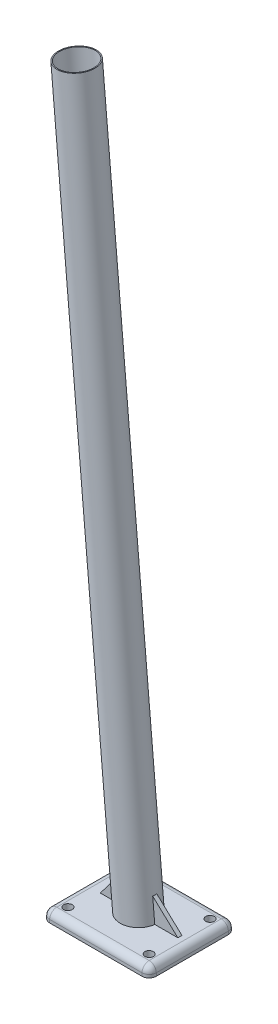
ISO-10303-21;
HEADER;
FILE_DESCRIPTION(('STEP AP214'),'2;1');
FILE_NAME('part.step','',(''),(''),'','','');
FILE_SCHEMA(('AUTOMOTIVE_DESIGN { 1 0 10303 214 1 1 1 1 }'));
ENDSEC;
DATA;
#1=APPLICATION_CONTEXT('core data for automotive mechanical design processes');
#2=APPLICATION_PROTOCOL_DEFINITION('international standard','automotive_design',2000,#1);
#3=PRODUCT_CONTEXT('',#1,'mechanical');
#4=PRODUCT('Part','Part','',(#3));
#5=PRODUCT_RELATED_PRODUCT_CATEGORY('part','',(#4));
#6=PRODUCT_DEFINITION_FORMATION('','',#4);
#7=PRODUCT_DEFINITION_CONTEXT('part definition',#1,'design');
#8=PRODUCT_DEFINITION('design','',#6,#7);
#9=PRODUCT_DEFINITION_SHAPE('','',#8);
#10=(LENGTH_UNIT() NAMED_UNIT(*) SI_UNIT(.MILLI.,.METRE.));
#11=(NAMED_UNIT(*) PLANE_ANGLE_UNIT() SI_UNIT($,.RADIAN.));
#12=(NAMED_UNIT(*) SI_UNIT($,.STERADIAN.) SOLID_ANGLE_UNIT());
#13=UNCERTAINTY_MEASURE_WITH_UNIT(LENGTH_MEASURE(1.E-05),#10,'distance_accuracy_value','');
#14=(GEOMETRIC_REPRESENTATION_CONTEXT(3) GLOBAL_UNCERTAINTY_ASSIGNED_CONTEXT((#13)) GLOBAL_UNIT_ASSIGNED_CONTEXT((#10,
#11,#12)) REPRESENTATION_CONTEXT('',''));
#15=CARTESIAN_POINT('',(0.,0.,0.));
#16=DIRECTION('',(0.,0.,1.));
#17=DIRECTION('',(1.,0.,0.));
#18=AXIS2_PLACEMENT_3D('',#15,#16,#17);
#19=CARTESIAN_POINT('',(0.,10.,0.));
#20=DIRECTION('',(0.,1.,0.));
#21=DIRECTION('',(0.,0.,1.));
#22=AXIS2_PLACEMENT_3D('',#19,#20,#21);
#23=PLANE('',#22);
#24=DIRECTION('',(0.,0.,-1.));
#25=VECTOR('',#24,1.);
#26=CARTESIAN_POINT('',(45.5,10.,-42.5));
#27=LINE('',#26,#25);
#28=CARTESIAN_POINT('',(45.5,10.,35.5));
#29=VERTEX_POINT('',#28);
#30=CARTESIAN_POINT('',(45.5,10.,-35.5));
#31=VERTEX_POINT('',#30);
#32=EDGE_CURVE('E257',#29,#31,#27,.T.);
#33=ORIENTED_EDGE('',*,*,#32,.T.);
#34=DIRECTION('',(-1.,0.,0.));
#35=VECTOR('',#34,1.);
#36=CARTESIAN_POINT('',(-45.5,10.,-35.5));
#37=LINE('',#36,#35);
#38=CARTESIAN_POINT('',(-45.5,10.,-35.5));
#39=VERTEX_POINT('',#38);
#40=EDGE_CURVE('E47',#31,#39,#37,.T.);
#41=ORIENTED_EDGE('',*,*,#40,.T.);
#42=DIRECTION('',(0.,0.,1.));
#43=VECTOR('',#42,1.);
#44=CARTESIAN_POINT('',(-45.5,10.,42.5));
#45=LINE('',#44,#43);
#46=CARTESIAN_POINT('',(-45.5,10.,35.5));
#47=VERTEX_POINT('',#46);
#48=EDGE_CURVE('E254',#39,#47,#45,.T.);
#49=ORIENTED_EDGE('',*,*,#48,.T.);
#50=DIRECTION('',(1.,0.,0.));
#51=VECTOR('',#50,1.);
#52=CARTESIAN_POINT('',(45.5,10.,35.5));
#53=LINE('',#52,#51);
#54=EDGE_CURVE('E307',#47,#29,#53,.T.);
#55=ORIENTED_EDGE('',*,*,#54,.T.);
#56=EDGE_LOOP('',(#33,#41,#49,#55));
#57=FACE_BOUND('',#56,.T.);
#58=DIRECTION('',(0.,0.,1.));
#59=VECTOR('',#58,1.);
#60=CARTESIAN_POINT('',(40.2682259659091,10.,0.));
#61=LINE('',#60,#59);
#62=CARTESIAN_POINT('',(40.2682259659091,10.,2.));
#63=VERTEX_POINT('',#62);
#64=CARTESIAN_POINT('',(40.2682259659091,10.,-2.));
#65=VERTEX_POINT('',#64);
#66=EDGE_CURVE('E202',#63,#65,#61,.F.);
#67=ORIENTED_EDGE('',*,*,#66,.F.);
#68=DIRECTION('',(1.,0.,0.));
#69=VECTOR('',#68,1.);
#70=CARTESIAN_POINT('',(0.,10.,2.));
#71=LINE('',#70,#69);
#72=CARTESIAN_POINT('',(17.5194318336482,10.,2.));
#73=VERTEX_POINT('',#72);
#74=EDGE_CURVE('E199',#73,#63,#71,.T.);
#75=ORIENTED_EDGE('',*,*,#74,.F.);
#76=CARTESIAN_POINT('',(-0.437443317629597,10.,0.));
#77=DIRECTION('',(0.,1.,0.));
#78=DIRECTION('',(-1.,0.,0.));
#79=AXIS2_PLACEMENT_3D('',#76,#77,#78);
#80=ELLIPSE('',#79,18.0687570757802,18.);
#81=CARTESIAN_POINT('',(-18.3943184689074,10.,2.));
#82=VERTEX_POINT('',#81);
#83=EDGE_CURVE('E163',#73,#82,#80,.F.);
#84=ORIENTED_EDGE('',*,*,#83,.T.);
#85=DIRECTION('',(1.,0.,0.));
#86=VECTOR('',#85,1.);
#87=CARTESIAN_POINT('',(0.,10.,2.));
#88=LINE('',#87,#86);
#89=CARTESIAN_POINT('',(-36.1381515078671,10.,2.));
#90=VERTEX_POINT('',#89);
#91=EDGE_CURVE('E184',#90,#82,#88,.T.);
#92=ORIENTED_EDGE('',*,*,#91,.F.);
#93=DIRECTION('',(0.,0.,1.));
#94=VECTOR('',#93,1.);
#95=CARTESIAN_POINT('',(-36.1381515078671,10.,0.));
#96=LINE('',#95,#94);
#97=CARTESIAN_POINT('',(-36.1381515078671,10.,-2.));
#98=VERTEX_POINT('',#97);
#99=EDGE_CURVE('E170',#98,#90,#96,.T.);
#100=ORIENTED_EDGE('',*,*,#99,.F.);
#101=DIRECTION('',(1.,0.,0.));
#102=VECTOR('',#101,1.);
#103=CARTESIAN_POINT('',(0.,10.,-2.));
#104=LINE('',#103,#102);
#105=CARTESIAN_POINT('',(-18.3943184689074,10.,-2.));
#106=VERTEX_POINT('',#105);
#107=EDGE_CURVE('E167',#98,#106,#104,.T.);
#108=ORIENTED_EDGE('',*,*,#107,.T.);
#109=CARTESIAN_POINT('',(17.5194318336482,10.,-2.));
#110=VERTEX_POINT('',#109);
#111=EDGE_CURVE('E152',#106,#110,#80,.F.);
#112=ORIENTED_EDGE('',*,*,#111,.T.);
#113=DIRECTION('',(1.,0.,0.));
#114=VECTOR('',#113,1.);
#115=CARTESIAN_POINT('',(0.,10.,-2.));
#116=LINE('',#115,#114);
#117=EDGE_CURVE('E195',#110,#65,#116,.T.);
#118=ORIENTED_EDGE('',*,*,#117,.T.);
#119=EDGE_LOOP('',(#67,#75,#84,#92,#100,#108,#112,#118));
#120=FACE_BOUND('',#119,.T.);
#121=CARTESIAN_POINT('',(40.,10.,30.));
#122=DIRECTION('',(0.,1.,0.));
#123=DIRECTION('',(0.,0.,1.));
#124=AXIS2_PLACEMENT_3D('',#121,#122,#123);
#125=CIRCLE('',#124,4.2);
#126=CARTESIAN_POINT('',(40.,10.,34.2));
#127=VERTEX_POINT('',#126);
#128=EDGE_CURVE('E219',#127,#127,#125,.T.);
#129=ORIENTED_EDGE('',*,*,#128,.F.);
#130=EDGE_LOOP('',(#129));
#131=FACE_BOUND('',#130,.T.);
#132=CARTESIAN_POINT('',(-40.,10.,30.));
#133=DIRECTION('',(0.,1.,0.));
#134=DIRECTION('',(0.,0.,1.));
#135=AXIS2_PLACEMENT_3D('',#132,#133,#134);
#136=CIRCLE('',#135,4.2);
#137=CARTESIAN_POINT('',(-40.,10.,34.2));
#138=VERTEX_POINT('',#137);
#139=EDGE_CURVE('E231',#138,#138,#136,.T.);
#140=ORIENTED_EDGE('',*,*,#139,.F.);
#141=EDGE_LOOP('',(#140));
#142=FACE_BOUND('',#141,.T.);
#143=CARTESIAN_POINT('',(40.,10.,-30.));
#144=DIRECTION('',(0.,1.,0.));
#145=DIRECTION('',(0.,0.,1.));
#146=AXIS2_PLACEMENT_3D('',#143,#144,#145);
#147=CIRCLE('',#146,4.2);
#148=CARTESIAN_POINT('',(40.,10.,-25.8));
#149=VERTEX_POINT('',#148);
#150=EDGE_CURVE('E225',#149,#149,#147,.T.);
#151=ORIENTED_EDGE('',*,*,#150,.F.);
#152=EDGE_LOOP('',(#151));
#153=FACE_BOUND('',#152,.T.);
#154=CARTESIAN_POINT('',(-40.,10.,-30.));
#155=DIRECTION('',(0.,1.,0.));
#156=DIRECTION('',(0.,0.,1.));
#157=AXIS2_PLACEMENT_3D('',#154,#155,#156);
#158=CIRCLE('',#157,4.2);
#159=CARTESIAN_POINT('',(-40.,10.,-25.8));
#160=VERTEX_POINT('',#159);
#161=EDGE_CURVE('E213',#160,#160,#158,.T.);
#162=ORIENTED_EDGE('',*,*,#161,.F.);
#163=EDGE_LOOP('',(#162));
#164=FACE_BOUND('',#163,.T.);
#165=ADVANCED_FACE('F38',(#57,#120,#131,#142,#153,#164),#23,.T.);
#166=CARTESIAN_POINT('',(0.,0.,0.));
#167=DIRECTION('',(0.,1.,0.));
#168=DIRECTION('',(0.,0.,1.));
#169=AXIS2_PLACEMENT_3D('',#166,#167,#168);
#170=PLANE('',#169);
#171=DIRECTION('',(-1.,0.,0.));
#172=VECTOR('',#171,1.);
#173=CARTESIAN_POINT('',(52.5,0.,-42.5));
#174=LINE('',#173,#172);
#175=CARTESIAN_POINT('',(45.5,0.,-42.5));
#176=VERTEX_POINT('',#175);
#177=CARTESIAN_POINT('',(-45.5,0.,-42.5));
#178=VERTEX_POINT('',#177);
#179=EDGE_CURVE('E164',#176,#178,#174,.T.);
#180=ORIENTED_EDGE('',*,*,#179,.F.);
#181=CARTESIAN_POINT('',(45.5,0.,-35.5));
#182=DIRECTION('',(0.,1.,0.));
#183=DIRECTION('',(0.,0.,1.));
#184=AXIS2_PLACEMENT_3D('',#181,#182,#183);
#185=CIRCLE('',#184,7.);
#186=CARTESIAN_POINT('',(52.5,0.,-35.5));
#187=VERTEX_POINT('',#186);
#188=EDGE_CURVE('E289',#176,#187,#185,.F.);
#189=ORIENTED_EDGE('',*,*,#188,.T.);
#190=DIRECTION('',(0.,0.,-1.));
#191=VECTOR('',#190,1.);
#192=CARTESIAN_POINT('',(52.5,0.,42.5));
#193=LINE('',#192,#191);
#194=CARTESIAN_POINT('',(52.5,0.,35.5));
#195=VERTEX_POINT('',#194);
#196=EDGE_CURVE('E241',#195,#187,#193,.T.);
#197=ORIENTED_EDGE('',*,*,#196,.F.);
#198=CARTESIAN_POINT('',(45.5,0.,35.5));
#199=DIRECTION('',(0.,1.,0.));
#200=DIRECTION('',(0.,0.,1.));
#201=AXIS2_PLACEMENT_3D('',#198,#199,#200);
#202=CIRCLE('',#201,7.);
#203=CARTESIAN_POINT('',(45.5,0.,42.5));
#204=VERTEX_POINT('',#203);
#205=EDGE_CURVE('E268',#195,#204,#202,.F.);
#206=ORIENTED_EDGE('',*,*,#205,.T.);
#207=DIRECTION('',(1.,0.,0.));
#208=VECTOR('',#207,1.);
#209=CARTESIAN_POINT('',(52.5,0.,42.5));
#210=LINE('',#209,#208);
#211=CARTESIAN_POINT('',(-45.5,0.,42.5));
#212=VERTEX_POINT('',#211);
#213=EDGE_CURVE('E238',#212,#204,#210,.T.);
#214=ORIENTED_EDGE('',*,*,#213,.F.);
#215=CARTESIAN_POINT('',(-45.5,0.,35.5));
#216=DIRECTION('',(0.,1.,0.));
#217=DIRECTION('',(0.,0.,1.));
#218=AXIS2_PLACEMENT_3D('',#215,#216,#217);
#219=CIRCLE('',#218,7.);
#220=CARTESIAN_POINT('',(-52.5,0.,35.5));
#221=VERTEX_POINT('',#220);
#222=EDGE_CURVE('E265',#212,#221,#219,.F.);
#223=ORIENTED_EDGE('',*,*,#222,.T.);
#224=DIRECTION('',(0.,0.,1.));
#225=VECTOR('',#224,1.);
#226=CARTESIAN_POINT('',(-52.5,0.,42.5));
#227=LINE('',#226,#225);
#228=CARTESIAN_POINT('',(-52.5,0.,-35.5));
#229=VERTEX_POINT('',#228);
#230=EDGE_CURVE('E234',#229,#221,#227,.T.);
#231=ORIENTED_EDGE('',*,*,#230,.F.);
#232=CARTESIAN_POINT('',(-45.5,0.,-35.5));
#233=DIRECTION('',(0.,1.,0.));
#234=DIRECTION('',(0.,0.,1.));
#235=AXIS2_PLACEMENT_3D('',#232,#233,#234);
#236=CIRCLE('',#235,7.);
#237=EDGE_CURVE('E287',#229,#178,#236,.F.);
#238=ORIENTED_EDGE('',*,*,#237,.T.);
#239=EDGE_LOOP('',(#180,#189,#197,#206,#214,#223,#231,#238));
#240=FACE_BOUND('',#239,.T.);
#241=CARTESIAN_POINT('',(-40.,0.,30.));
#242=DIRECTION('',(0.,1.,0.));
#243=DIRECTION('',(0.,0.,1.));
#244=AXIS2_PLACEMENT_3D('',#241,#242,#243);
#245=CIRCLE('',#244,4.2);
#246=CARTESIAN_POINT('',(-40.,0.,34.2));
#247=VERTEX_POINT('',#246);
#248=EDGE_CURVE('E228',#247,#247,#245,.T.);
#249=ORIENTED_EDGE('',*,*,#248,.T.);
#250=EDGE_LOOP('',(#249));
#251=FACE_BOUND('',#250,.T.);
#252=CARTESIAN_POINT('',(40.,0.,-30.));
#253=DIRECTION('',(0.,1.,0.));
#254=DIRECTION('',(0.,0.,1.));
#255=AXIS2_PLACEMENT_3D('',#252,#253,#254);
#256=CIRCLE('',#255,4.2);
#257=CARTESIAN_POINT('',(40.,0.,-25.8));
#258=VERTEX_POINT('',#257);
#259=EDGE_CURVE('E222',#258,#258,#256,.T.);
#260=ORIENTED_EDGE('',*,*,#259,.T.);
#261=EDGE_LOOP('',(#260));
#262=FACE_BOUND('',#261,.T.);
#263=CARTESIAN_POINT('',(40.,0.,30.));
#264=DIRECTION('',(0.,1.,0.));
#265=DIRECTION('',(0.,0.,1.));
#266=AXIS2_PLACEMENT_3D('',#263,#264,#265);
#267=CIRCLE('',#266,4.2);
#268=CARTESIAN_POINT('',(40.,0.,34.2));
#269=VERTEX_POINT('',#268);
#270=EDGE_CURVE('E216',#269,#269,#267,.T.);
#271=ORIENTED_EDGE('',*,*,#270,.T.);
#272=EDGE_LOOP('',(#271));
#273=FACE_BOUND('',#272,.T.);
#274=CARTESIAN_POINT('',(-40.,0.,-30.));
#275=DIRECTION('',(0.,1.,0.));
#276=DIRECTION('',(0.,0.,1.));
#277=AXIS2_PLACEMENT_3D('',#274,#275,#276);
#278=CIRCLE('',#277,4.2);
#279=CARTESIAN_POINT('',(-40.,0.,-25.8));
#280=VERTEX_POINT('',#279);
#281=EDGE_CURVE('E212',#280,#280,#278,.T.);
#282=ORIENTED_EDGE('',*,*,#281,.T.);
#283=EDGE_LOOP('',(#282));
#284=FACE_BOUND('',#283,.T.);
#285=ADVANCED_FACE('F408',(#240,#251,#262,#273,#284),#170,.F.);
#286=CARTESIAN_POINT('',(-52.5,10.,42.5));
#287=DIRECTION('',(1.,0.,0.));
#288=DIRECTION('',(0.,0.,-1.));
#289=AXIS2_PLACEMENT_3D('',#286,#287,#288);
#290=PLANE('',#289);
#291=DIRECTION('',(0.,0.,1.));
#292=VECTOR('',#291,1.);
#293=CARTESIAN_POINT('',(-52.5,3.,-42.5));
#294=LINE('',#293,#292);
#295=CARTESIAN_POINT('',(-52.5,3.,35.5));
#296=VERTEX_POINT('',#295);
#297=CARTESIAN_POINT('',(-52.5,3.,-35.5));
#298=VERTEX_POINT('',#297);
#299=EDGE_CURVE('E277',#296,#298,#294,.F.);
#300=ORIENTED_EDGE('',*,*,#299,.T.);
#301=DIRECTION('',(0.,-1.,0.));
#302=VECTOR('',#301,1.);
#303=CARTESIAN_POINT('',(-52.5,10.,-35.5));
#304=LINE('',#303,#302);
#305=EDGE_CURVE('E297',#298,#229,#304,.T.);
#306=ORIENTED_EDGE('',*,*,#305,.T.);
#307=ORIENTED_EDGE('',*,*,#230,.T.);
#308=DIRECTION('',(0.,-1.,0.));
#309=VECTOR('',#308,1.);
#310=CARTESIAN_POINT('',(-52.5,10.,35.5));
#311=LINE('',#310,#309);
#312=EDGE_CURVE('E274',#221,#296,#311,.F.);
#313=ORIENTED_EDGE('',*,*,#312,.T.);
#314=EDGE_LOOP('',(#300,#306,#307,#313));
#315=FACE_BOUND('',#314,.T.);
#316=ADVANCED_FACE('F411',(#315),#290,.F.);
#317=CARTESIAN_POINT('',(52.5,10.,42.5));
#318=DIRECTION('',(0.,0.,-1.));
#319=DIRECTION('',(-1.,0.,0.));
#320=AXIS2_PLACEMENT_3D('',#317,#318,#319);
#321=PLANE('',#320);
#322=DIRECTION('',(0.,-1.,0.));
#323=VECTOR('',#322,1.);
#324=CARTESIAN_POINT('',(45.5,10.,42.5));
#325=LINE('',#324,#323);
#326=CARTESIAN_POINT('',(45.5,3.,42.5));
#327=VERTEX_POINT('',#326);
#328=EDGE_CURVE('E272',#204,#327,#325,.F.);
#329=ORIENTED_EDGE('',*,*,#328,.T.);
#330=DIRECTION('',(1.,0.,0.));
#331=VECTOR('',#330,1.);
#332=CARTESIAN_POINT('',(-45.5,3.,42.5));
#333=LINE('',#332,#331);
#334=CARTESIAN_POINT('',(-45.5,3.,42.5));
#335=VERTEX_POINT('',#334);
#336=EDGE_CURVE('E11',#327,#335,#333,.F.);
#337=ORIENTED_EDGE('',*,*,#336,.T.);
#338=DIRECTION('',(0.,-1.,0.));
#339=VECTOR('',#338,1.);
#340=CARTESIAN_POINT('',(-45.5,10.,42.5));
#341=LINE('',#340,#339);
#342=EDGE_CURVE('E270',#335,#212,#341,.T.);
#343=ORIENTED_EDGE('',*,*,#342,.T.);
#344=ORIENTED_EDGE('',*,*,#213,.T.);
#345=EDGE_LOOP('',(#329,#337,#343,#344));
#346=FACE_BOUND('',#345,.T.);
#347=ADVANCED_FACE('F419',(#346),#321,.F.);
#348=CARTESIAN_POINT('',(52.5,10.,42.5));
#349=DIRECTION('',(-1.,0.,0.));
#350=DIRECTION('',(0.,0.,1.));
#351=AXIS2_PLACEMENT_3D('',#348,#349,#350);
#352=PLANE('',#351);
#353=ORIENTED_EDGE('',*,*,#196,.T.);
#354=DIRECTION('',(0.,-1.,0.));
#355=VECTOR('',#354,1.);
#356=CARTESIAN_POINT('',(52.5,10.,-35.5));
#357=LINE('',#356,#355);
#358=CARTESIAN_POINT('',(52.5,3.,-35.5));
#359=VERTEX_POINT('',#358);
#360=EDGE_CURVE('E291',#187,#359,#357,.F.);
#361=ORIENTED_EDGE('',*,*,#360,.T.);
#362=DIRECTION('',(0.,0.,-1.));
#363=VECTOR('',#362,1.);
#364=CARTESIAN_POINT('',(52.5,3.,42.5));
#365=LINE('',#364,#363);
#366=CARTESIAN_POINT('',(52.5,3.,35.5));
#367=VERTEX_POINT('',#366);
#368=EDGE_CURVE('E262',#359,#367,#365,.F.);
#369=ORIENTED_EDGE('',*,*,#368,.T.);
#370=DIRECTION('',(0.,-1.,0.));
#371=VECTOR('',#370,1.);
#372=CARTESIAN_POINT('',(52.5,10.,35.5));
#373=LINE('',#372,#371);
#374=EDGE_CURVE('E260',#367,#195,#373,.T.);
#375=ORIENTED_EDGE('',*,*,#374,.T.);
#376=EDGE_LOOP('',(#353,#361,#369,#375));
#377=FACE_BOUND('',#376,.T.);
#378=ADVANCED_FACE('F415',(#377),#352,.F.);
#379=CARTESIAN_POINT('',(52.5,10.,-42.5));
#380=DIRECTION('',(0.,0.,1.));
#381=DIRECTION('',(1.,0.,0.));
#382=AXIS2_PLACEMENT_3D('',#379,#380,#381);
#383=PLANE('',#382);
#384=DIRECTION('',(-1.,0.,0.));
#385=VECTOR('',#384,1.);
#386=CARTESIAN_POINT('',(45.5,3.,-42.5));
#387=LINE('',#386,#385);
#388=CARTESIAN_POINT('',(-45.5,3.,-42.5));
#389=VERTEX_POINT('',#388);
#390=CARTESIAN_POINT('',(45.5,3.,-42.5));
#391=VERTEX_POINT('',#390);
#392=EDGE_CURVE('E280',#389,#391,#387,.F.);
#393=ORIENTED_EDGE('',*,*,#392,.T.);
#394=DIRECTION('',(0.,-1.,0.));
#395=VECTOR('',#394,1.);
#396=CARTESIAN_POINT('',(45.5,10.,-42.5));
#397=LINE('',#396,#395);
#398=EDGE_CURVE('E284',#391,#176,#397,.T.);
#399=ORIENTED_EDGE('',*,*,#398,.T.);
#400=ORIENTED_EDGE('',*,*,#179,.T.);
#401=DIRECTION('',(0.,-1.,0.));
#402=VECTOR('',#401,1.);
#403=CARTESIAN_POINT('',(-45.5,10.,-42.5));
#404=LINE('',#403,#402);
#405=EDGE_CURVE('E282',#178,#389,#404,.F.);
#406=ORIENTED_EDGE('',*,*,#405,.T.);
#407=EDGE_LOOP('',(#393,#399,#400,#406));
#408=FACE_BOUND('',#407,.T.);
#409=ADVANCED_FACE('F403',(#408),#383,.F.);
#410=CARTESIAN_POINT('',(-40.,10.,30.));
#411=DIRECTION('',(0.,-1.,0.));
#412=DIRECTION('',(0.,0.,-1.));
#413=AXIS2_PLACEMENT_3D('',#410,#411,#412);
#414=CYLINDRICAL_SURFACE('',#413,4.2);
#415=ORIENTED_EDGE('',*,*,#139,.T.);
#416=EDGE_LOOP('',(#415));
#417=FACE_BOUND('',#416,.T.);
#418=ORIENTED_EDGE('',*,*,#248,.F.);
#419=EDGE_LOOP('',(#418));
#420=FACE_BOUND('',#419,.T.);
#421=ADVANCED_FACE('F399',(#417,#420),#414,.F.);
#422=CARTESIAN_POINT('',(40.,10.,-30.));
#423=DIRECTION('',(0.,-1.,0.));
#424=DIRECTION('',(0.,0.,-1.));
#425=AXIS2_PLACEMENT_3D('',#422,#423,#424);
#426=CYLINDRICAL_SURFACE('',#425,4.2);
#427=ORIENTED_EDGE('',*,*,#150,.T.);
#428=EDGE_LOOP('',(#427));
#429=FACE_BOUND('',#428,.T.);
#430=ORIENTED_EDGE('',*,*,#259,.F.);
#431=EDGE_LOOP('',(#430));
#432=FACE_BOUND('',#431,.T.);
#433=ADVANCED_FACE('F395',(#429,#432),#426,.F.);
#434=CARTESIAN_POINT('',(40.,10.,30.));
#435=DIRECTION('',(0.,-1.,0.));
#436=DIRECTION('',(0.,0.,-1.));
#437=AXIS2_PLACEMENT_3D('',#434,#435,#436);
#438=CYLINDRICAL_SURFACE('',#437,4.2);
#439=ORIENTED_EDGE('',*,*,#128,.T.);
#440=EDGE_LOOP('',(#439));
#441=FACE_BOUND('',#440,.T.);
#442=ORIENTED_EDGE('',*,*,#270,.F.);
#443=EDGE_LOOP('',(#442));
#444=FACE_BOUND('',#443,.T.);
#445=ADVANCED_FACE('F391',(#441,#444),#438,.F.);
#446=CARTESIAN_POINT('',(-40.,10.,-30.));
#447=DIRECTION('',(0.,-1.,0.));
#448=DIRECTION('',(0.,0.,-1.));
#449=AXIS2_PLACEMENT_3D('',#446,#447,#448);
#450=CYLINDRICAL_SURFACE('',#449,4.2);
#451=ORIENTED_EDGE('',*,*,#161,.T.);
#452=EDGE_LOOP('',(#451));
#453=FACE_BOUND('',#452,.T.);
#454=ORIENTED_EDGE('',*,*,#281,.F.);
#455=EDGE_LOOP('',(#454));
#456=FACE_BOUND('',#455,.T.);
#457=ADVANCED_FACE('F385',(#453,#456),#450,.F.);
#458=CARTESIAN_POINT('',(4.01492321229937,-40.890782308154,0.));
#459=DIRECTION('',(-0.087155742747655,0.996194698091746,0.));
#460=DIRECTION('',(-0.996194698091746,-0.087155742747655,0.));
#461=AXIS2_PLACEMENT_3D('',#458,#459,#460);
#462=CYLINDRICAL_SURFACE('',#461,17.);
#463=CARTESIAN_POINT('',(-73.6633245524373,651.922527253279,0.));
#464=CARTESIAN_POINT('',(-73.6633211761043,651.922534384095,0.226783884518187));
#465=CARTESIAN_POINT('',(-73.6604039510326,651.94173446471,0.453645555059687));
#466=CARTESIAN_POINT('',(-73.6491735202783,652.017892701405,0.900884028469324));
#467=CARTESIAN_POINT('',(-73.6408570219155,652.074873898285,1.12125678837223));
#468=CARTESIAN_POINT('',(-73.6201275065507,652.224583923957,1.54899287722574));
#469=CARTESIAN_POINT('',(-73.6077192251096,652.317271449354,1.75637091678638));
#470=CARTESIAN_POINT('',(-73.5807452614086,652.535484422615,2.15287285305607));
#471=CARTESIAN_POINT('',(-73.5661795434073,652.661010414527,2.34199644726548));
#472=CARTESIAN_POINT('',(-73.5370178616275,652.943717100775,2.70026657382888));
#473=CARTESIAN_POINT('',(-73.5224257280247,653.101407509832,2.86901123319018));
#474=CARTESIAN_POINT('',(-73.4961795064976,653.442650431748,3.17824298464177));
#475=CARTESIAN_POINT('',(-73.4845257284311,653.626205668948,3.31872709626243));
#476=CARTESIAN_POINT('',(-73.4666833331404,654.016863815303,3.5693053070452));
#477=CARTESIAN_POINT('',(-73.4605718474037,654.224255104904,3.67895627242358));
#478=CARTESIAN_POINT('',(-73.456451380206,654.654574331039,3.86190806350517));
#479=CARTESIAN_POINT('',(-73.4584412010769,654.877499966243,3.93521426049203));
#480=CARTESIAN_POINT('',(-73.4719724713077,655.328009229681,4.04203720828286));
#481=CARTESIAN_POINT('',(-73.4833343543287,655.555427454081,4.07627336890214));
#482=CARTESIAN_POINT('',(-73.515832742659,656.012079411221,4.10622414884445));
#483=CARTESIAN_POINT('',(-73.5369677738687,656.241312865045,4.10194457576043));
#484=CARTESIAN_POINT('',(-73.5876980515532,656.689665883619,4.05556080667586));
#485=CARTESIAN_POINT('',(-73.6170928484571,656.908896973451,4.01430738744924));
#486=CARTESIAN_POINT('',(-73.6827977713126,657.336562249265,3.89650139135604));
#487=CARTESIAN_POINT('',(-73.7191083592451,657.544995712773,3.81994645583127));
#488=CARTESIAN_POINT('',(-73.7964994438431,657.947569149004,3.63296916979944));
#489=CARTESIAN_POINT('',(-73.8376218903461,658.141554912694,3.52223268109689));
#490=CARTESIAN_POINT('',(-73.9212729474018,658.508255222096,3.27025571318877));
#491=CARTESIAN_POINT('',(-73.9638017872317,658.6809662776,3.12901023928996));
#492=CARTESIAN_POINT('',(-74.0480737454577,659.005201781033,2.81558924275903));
#493=CARTESIAN_POINT('',(-74.089766283456,659.1560445668,2.64269409004446));
#494=CARTESIAN_POINT('',(-74.1676669959096,659.427037092286,2.27321299014638));
#495=CARTESIAN_POINT('',(-74.2038750248944,659.547186017942,2.07662641482208));
#496=CARTESIAN_POINT('',(-74.2677622093632,659.753783905575,1.66440938030647));
#497=CARTESIAN_POINT('',(-74.2954152990951,659.840130083167,1.44872324578638));
#498=CARTESIAN_POINT('',(-74.3395265145262,659.97595938951,1.0049587192484));
#499=CARTESIAN_POINT('',(-74.355986629082,660.025449067364,0.776882536574067));
#500=CARTESIAN_POINT('',(-74.3759346942021,660.085242124933,0.320661298032404));
#501=CARTESIAN_POINT('',(-74.379723452355,660.09645431713,0.0926483252854091));
#502=CARTESIAN_POINT('',(-74.3748308372839,660.081876702999,-0.362042704757806));
#503=CARTESIAN_POINT('',(-74.3661505039347,660.056089982241,-0.588720871788806));
#504=CARTESIAN_POINT('',(-74.3373086788977,659.96895395118,-1.03111492085445));
#505=CARTESIAN_POINT('',(-74.3173056106964,659.908095148257,-1.24693823881068));
#506=CARTESIAN_POINT('',(-74.2676599622723,659.753002351202,-1.66505169574244));
#507=CARTESIAN_POINT('',(-74.2380164493371,659.658765127633,-1.86734052297279));
#508=CARTESIAN_POINT('',(-74.1709922352523,659.437645636793,-2.25639243376611));
#509=CARTESIAN_POINT('',(-74.1334901732761,659.310242655627,-2.44283844258723));
#510=CARTESIAN_POINT('',(-74.0541598441387,659.026887905601,-2.79156967687475));
#511=CARTESIAN_POINT('',(-74.0123308854411,658.870931570192,-2.95385103013909));
#512=CARTESIAN_POINT('',(-73.926735425918,658.530463573782,-3.25344026182161));
#513=CARTESIAN_POINT('',(-73.8829464960987,658.345383594516,-3.3900969046902));
#514=CARTESIAN_POINT('',(-73.7979258270194,657.954103501913,-3.62988167975358));
#515=CARTESIAN_POINT('',(-73.7566939733367,657.747904334704,-3.73301131307497));
#516=CARTESIAN_POINT('',(-73.6802551585091,657.321180393034,-3.90206064379559));
#517=CARTESIAN_POINT('',(-73.6450135034175,657.100749083309,-3.96820007638687));
#518=CARTESIAN_POINT('',(-73.582760906677,656.650737740522,-4.06199349040149));
#519=CARTESIAN_POINT('',(-73.5557483130978,656.421159554113,-4.08965519995765));
#520=CARTESIAN_POINT('',(-73.5120100887896,655.965891736243,-4.10532557497996));
#521=CARTESIAN_POINT('',(-73.4950292421667,655.740261765589,-4.09437244119044));
#522=CARTESIAN_POINT('',(-73.4704874677822,655.293371790288,-4.03548389363411));
#523=CARTESIAN_POINT('',(-73.4629263754771,655.072111709375,-3.98754912588306));
#524=CARTESIAN_POINT('',(-73.4564036416109,654.641375972731,-3.85660650295149));
#525=CARTESIAN_POINT('',(-73.4573979087249,654.431845490346,-3.77378056510709));
#526=CARTESIAN_POINT('',(-73.4662012386308,654.028966643134,-3.57555307498964));
#527=CARTESIAN_POINT('',(-73.4740111805734,653.835620369426,-3.46014732156087));
#528=CARTESIAN_POINT('',(-73.4944633878205,653.46568590755,-3.19672599941454));
#529=CARTESIAN_POINT('',(-73.5072187932965,653.289621028441,-3.04798417919837));
#530=CARTESIAN_POINT('',(-73.5348699850437,652.964502796525,-2.72354523912472));
#531=CARTESIAN_POINT('',(-73.5497662738323,652.815455804101,-2.54784179005882));
#532=CARTESIAN_POINT('',(-73.5792799821056,652.546408678437,-2.17096189162719));
#533=CARTESIAN_POINT('',(-73.5938887202414,652.426929475591,-1.96941234816268));
#534=CARTESIAN_POINT('',(-73.6200613040128,652.224114429094,-1.54880202734468));
#535=CARTESIAN_POINT('',(-73.631627440817,652.140751358149,-1.32975458940992));
#536=CARTESIAN_POINT('',(-73.6479956651623,652.025789723356,-0.925753994232908));
#537=CARTESIAN_POINT('',(-73.6536904848183,651.987150631375,-0.742808917301689));
#538=CARTESIAN_POINT('',(-73.6613561969936,651.935517294526,-0.37325996603402));
#539=CARTESIAN_POINT('',(-73.6633273313558,651.922521384202,-0.186656330106073));
#540=CARTESIAN_POINT('',(-73.6633245524373,651.922527253279,0.));
#541=B_SPLINE_CURVE_WITH_KNOTS('',3,(#463,#464,#465,#466,#467,#468,#469,#470,#471,#472,#473,
#474,#475,#476,#477,#478,#479,#480,#481,#482,#483,#484,#485,#486,#487,#488,#489,#490,#491,#492,
#493,#494,#495,#496,#497,#498,#499,#500,#501,#502,#503,#504,#505,#506,#507,#508,#509,#510,#511,
#512,#513,#514,#515,#516,#517,#518,#519,#520,#521,#522,#523,#524,#525,#526,#527,#528,#529,#530,
#531,#532,#533,#534,#535,#536,#537,#538,#539,#540),.UNSPECIFIED.,.T.,.F.,(4,2,2,2,2,2,2,2,2,2,2,
2,2,2,2,2,2,2,2,2,2,2,2,2,2,2,2,2,2,2,2,2,2,2,2,2,2,2,4),(0.,0.679667865998944,1.35975060890577,
2.03904901503379,2.71835867607837,3.40941186450492,4.10053789598049,4.80114089501642,
5.50164032316309,6.18902185064749,6.87629973307951,7.54815804223589,8.22006124787112,
8.89833316573191,9.57671620925972,10.2730524905239,10.9694072381123,11.6678632513664,
12.3661951249777,13.0478268346067,13.7294017020436,14.401667934706,15.0739992284338,
15.7576000253243,16.4413102464275,17.1405558184758,17.8397700784345,18.5347853937936,
19.2296610972902,19.9059984679953,20.5823240243303,21.2551661316105,21.9280950413047,
22.6174254584248,23.306917943247,24.0078089580957,24.708170660611,25.2676131894585,
25.8270193828391),.UNSPECIFIED.);
#542=CARTESIAN_POINT('',(-73.6633245524373,651.922527253279,0.));
#543=VERTEX_POINT('',#542);
#544=EDGE_CURVE('E322',#543,#543,#541,.T.);
#545=ORIENTED_EDGE('',*,*,#544,.T.);
#546=EDGE_LOOP('',(#545));
#547=FACE_BOUND('',#546,.T.);
#548=CARTESIAN_POINT('',(-0.437443317629597,10.,0.));
#549=DIRECTION('',(0.,1.,0.));
#550=DIRECTION('',(-1.,0.,0.));
#551=AXIS2_PLACEMENT_3D('',#548,#549,#550);
#552=ELLIPSE('',#551,17.0649372382369,17.);
#553=CARTESIAN_POINT('',(-17.5023805558665,10.,0.));
#554=VERTEX_POINT('',#553);
#555=EDGE_CURVE('E247',#554,#554,#552,.F.);
#556=ORIENTED_EDGE('',*,*,#555,.T.);
#557=EDGE_LOOP('',(#556));
#558=FACE_BOUND('',#557,.T.);
#559=CARTESIAN_POINT('',(-61.4431403675258,707.298308046752,0.));
#560=DIRECTION('',(0.0871557427476551,-0.996194698091746,0.));
#561=DIRECTION('',(0.996194698091746,0.0871557427476551,0.));
#562=AXIS2_PLACEMENT_3D('',#559,#560,#561);
#563=CIRCLE('',#562,17.);
#564=CARTESIAN_POINT('',(-44.5078304999662,708.779955673463,0.));
#565=VERTEX_POINT('',#564);
#566=EDGE_CURVE('E206',#565,#565,#563,.T.);
#567=ORIENTED_EDGE('',*,*,#566,.F.);
#568=EDGE_LOOP('',(#567));
#569=FACE_BOUND('',#568,.T.);
#570=ADVANCED_FACE('F382',(#547,#558,#569),#462,.F.);
#571=CARTESIAN_POINT('',(4.01492321229937,-40.890782308154,0.));
#572=DIRECTION('',(-0.087155742747655,0.996194698091746,0.));
#573=DIRECTION('',(-0.996194698091746,-0.087155742747655,0.));
#574=AXIS2_PLACEMENT_3D('',#571,#572,#573);
#575=CYLINDRICAL_SURFACE('',#574,18.);
#576=CARTESIAN_POINT('',(-74.6595192505292,651.835371510531,0.));
#577=CARTESIAN_POINT('',(-74.6595157728591,651.835379254462,0.227156322384174));
#578=CARTESIAN_POINT('',(-74.6568431963005,651.854619722306,0.45440021630104));
#579=CARTESIAN_POINT('',(-74.6465661698382,651.930954717592,0.902417089957943));
#580=CARTESIAN_POINT('',(-74.6389583978843,651.988074743648,1.12318560619574));
#581=CARTESIAN_POINT('',(-74.6200391108565,652.138188645735,1.55171362315712));
#582=CARTESIAN_POINT('',(-74.6087316289534,652.231143476692,1.75948699780861));
#583=CARTESIAN_POINT('',(-74.5842497791246,652.4500291263,2.15670907972025));
#584=CARTESIAN_POINT('',(-74.5710754280216,652.57595964781,2.34615795207987));
#585=CARTESIAN_POINT('',(-74.5449094570418,652.85936063568,2.70463870385847));
#586=CARTESIAN_POINT('',(-74.5319238502032,653.017290443601,2.87330791278208));
#587=CARTESIAN_POINT('',(-74.5088962594275,653.359011141348,3.18229464066864));
#588=CARTESIAN_POINT('',(-74.4988545560101,653.5428044932,3.32260945739327));
#589=CARTESIAN_POINT('',(-74.4840996882215,653.93358042136,3.57253355029193));
#590=CARTESIAN_POINT('',(-74.479452375233,654.140816361353,3.68175132213681));
#591=CARTESIAN_POINT('',(-74.4778782791765,654.570706635396,3.86386800531117));
#592=CARTESIAN_POINT('',(-74.4809504883105,654.793358953119,3.93677165602813));
#593=CARTESIAN_POINT('',(-74.4961117274037,655.243675984361,4.04298128990118));
#594=CARTESIAN_POINT('',(-74.5080483359231,655.471193549937,4.07693222979405));
#595=CARTESIAN_POINT('',(-74.5411404314453,655.928023786205,4.10627913235936));
#596=CARTESIAN_POINT('',(-74.5622946853012,656.157336212749,4.10168025076971));
#597=CARTESIAN_POINT('',(-74.6125833644707,656.606449269094,4.05457584393416));
#598=CARTESIAN_POINT('',(-74.6415510019572,656.826348355935,4.01282477701819));
#599=CARTESIAN_POINT('',(-74.7059759828909,657.255305017477,3.89379872247779));
#600=CARTESIAN_POINT('',(-74.7414337177968,657.464361937242,3.81652159162673));
#601=CARTESIAN_POINT('',(-74.8167470719431,657.86789660131,3.62795822581149));
#602=CARTESIAN_POINT('',(-74.8566377507774,658.062234172896,3.51638643337125));
#603=CARTESIAN_POINT('',(-74.937610500879,658.429481431854,3.2626013238187));
#604=CARTESIAN_POINT('',(-74.9786927466901,658.602387960188,3.12038349777699));
#605=CARTESIAN_POINT('',(-75.0598325394343,658.926311699153,2.80537328087236));
#606=CARTESIAN_POINT('',(-75.099843283136,659.076718666374,2.63194064357507));
#607=CARTESIAN_POINT('',(-75.1744803542875,659.346727932691,2.26151625707771));
#608=CARTESIAN_POINT('',(-75.2091065675334,659.466329578454,2.06452400834394));
#609=CARTESIAN_POINT('',(-75.2700739630114,659.671672781878,1.65179054108898));
#610=CARTESIAN_POINT('',(-75.2963945572207,659.757330330932,1.43600439789239));
#611=CARTESIAN_POINT('',(-75.3382676920267,659.891766222528,0.992246921364317));
#612=CARTESIAN_POINT('',(-75.3538219339489,659.940550392004,0.764277519397232));
#613=CARTESIAN_POINT('',(-75.3725279723386,659.999053236416,0.307869501642531));
#614=CARTESIAN_POINT('',(-75.3759387337774,660.009587701088,0.0795459175807584));
#615=CARTESIAN_POINT('',(-75.3707748032375,659.993527193941,-0.375642058808755));
#616=CARTESIAN_POINT('',(-75.362200996746,659.966934965249,-0.602506557697767));
#617=CARTESIAN_POINT('',(-75.3340102267373,659.87800907506,-1.04553168145842));
#618=CARTESIAN_POINT('',(-75.3145270852291,659.816108364792,-1.26178811681278));
#619=CARTESIAN_POINT('',(-75.2662824933376,659.658714132299,-1.68060033640372));
#620=CARTESIAN_POINT('',(-75.2375202081138,659.563217587402,-1.88315488590332));
#621=CARTESIAN_POINT('',(-75.1726006362139,659.33953623084,-2.27223152524648));
#622=CARTESIAN_POINT('',(-75.136337121839,659.210874478928,-2.45846152619733));
#623=CARTESIAN_POINT('',(-75.059669710697,658.92495521063,-2.8065385813707));
#624=CARTESIAN_POINT('',(-75.0192652278633,658.767693644099,-2.96838217618412));
#625=CARTESIAN_POINT('',(-74.9367065412643,658.425068609044,-3.26643394695659));
#626=CARTESIAN_POINT('',(-74.8945334918885,658.239203821511,-3.4020614556746));
#627=CARTESIAN_POINT('',(-74.8126116318162,657.846598536045,-3.63968580146691));
#628=CARTESIAN_POINT('',(-74.7728627139174,657.639858962331,-3.74168412660277));
#629=CARTESIAN_POINT('',(-74.699056193609,657.212329374417,-3.90843962722669));
#630=CARTESIAN_POINT('',(-74.6649665692394,656.99162890807,-3.97341178032032));
#631=CARTESIAN_POINT('',(-74.6045433312989,656.541381274975,-4.06488617310546));
#632=CARTESIAN_POINT('',(-74.578208356161,656.311835669277,-4.09139516940033));
#633=CARTESIAN_POINT('',(-74.5351791064681,655.856205360063,-4.10488454353032));
#634=CARTESIAN_POINT('',(-74.5182710097969,655.630167681276,-4.09278745084494));
#635=CARTESIAN_POINT('',(-74.4933761657236,655.182692600779,-4.03148396785147));
#636=CARTESIAN_POINT('',(-74.485389294226,654.961255135121,-3.98227809374753));
#637=CARTESIAN_POINT('',(-74.4775717998254,654.530163697441,-3.84861626866043));
#638=CARTESIAN_POINT('',(-74.4777079434415,654.320465225263,-3.76430534899324));
#639=CARTESIAN_POINT('',(-74.4844735263298,653.917541798851,-3.56294750396711));
#640=CARTESIAN_POINT('',(-74.4911037070462,653.724318728404,-3.44589684170057));
#641=CARTESIAN_POINT('',(-74.5089442334062,653.355441289743,-3.17936890686794));
#642=CARTESIAN_POINT('',(-74.5202515110421,653.180263172745,-3.02923886317156));
#643=CARTESIAN_POINT('',(-74.5449354966821,652.857184573451,-2.70212298851048));
#644=CARTESIAN_POINT('',(-74.5583126850691,652.709290440707,-2.52513092361739));
#645=CARTESIAN_POINT('',(-74.5848245676489,652.443122349779,-2.14625609135119));
#646=CARTESIAN_POINT('',(-74.5979530390053,652.325303267475,-1.94405295672753));
#647=CARTESIAN_POINT('',(-74.6214353673481,652.125868166032,-1.52248333237065));
#648=CARTESIAN_POINT('',(-74.631791456869,652.044222981978,-1.30313083766695));
#649=CARTESIAN_POINT('',(-74.6462097844317,651.933470263777,-0.903096014671083));
#650=CARTESIAN_POINT('',(-74.6511551247621,651.896759040656,-0.724512595868075));
#651=CARTESIAN_POINT('',(-74.6578111673522,651.847707192436,-0.363971409254657));
#652=CARTESIAN_POINT('',(-74.659522037086,651.835365305542,-0.182013816644556));
#653=CARTESIAN_POINT('',(-74.6595192505292,651.835371510531,0.));
#654=B_SPLINE_CURVE_WITH_KNOTS('',3,(#576,#577,#578,#579,#580,#581,#582,#583,#584,#585,#586,
#587,#588,#589,#590,#591,#592,#593,#594,#595,#596,#597,#598,#599,#600,#601,#602,#603,#604,#605,
#606,#607,#608,#609,#610,#611,#612,#613,#614,#615,#616,#617,#618,#619,#620,#621,#622,#623,#624,
#625,#626,#627,#628,#629,#630,#631,#632,#633,#634,#635,#636,#637,#638,#639,#640,#641,#642,#643,
#644,#645,#646,#647,#648,#649,#650,#651,#652,#653),.UNSPECIFIED.,.T.,.F.,(4,2,2,2,2,2,2,2,2,2,2,
2,2,2,2,2,2,2,2,2,2,2,2,2,2,2,2,2,2,2,2,2,2,2,2,2,2,2,4),(0.,0.68080251681005,1.36206378146792,
2.04258484239261,2.72309977141049,3.41418059121075,4.10532724156192,4.80482508733522,
5.50423161710208,6.19188261477734,6.87944164596295,7.55334903112797,8.22729707730829,
8.90701622021354,9.58683543808482,10.2826384883395,10.9784562943007,11.67598559009,
12.3734046354081,13.0558587492144,13.7382624421456,14.4124730748556,15.0867443829259,
15.7713131188447,16.4559788751376,17.1544066025312,17.8528034209683,18.5471028472824,
19.2412802952043,19.9189950168745,20.5967003113236,21.2716331185811,21.9466429939914,
22.6364051054443,23.3263275369746,24.0261375529485,24.7253823213909,25.2709180113349,
25.8164254538099),.UNSPECIFIED.);
#655=CARTESIAN_POINT('',(-74.6595192505292,651.835371510531,0.));
#656=VERTEX_POINT('',#655);
#657=EDGE_CURVE('E330',#656,#656,#654,.T.);
#658=ORIENTED_EDGE('',*,*,#657,.F.);
#659=EDGE_LOOP('',(#658));
#660=FACE_BOUND('',#659,.T.);
#661=DIRECTION('',(-0.087155742747655,0.996194698091746,0.));
#662=VECTOR('',#661,1.);
#663=CARTESIAN_POINT('',(21.8353957223636,-39.3316929848481,2.));
#664=LINE('',#663,#662);
#665=CARTESIAN_POINT('',(15.4941130229145,33.1494999364525,2.));
#666=VERTEX_POINT('',#665);
#667=EDGE_CURVE('E197',#73,#666,#664,.T.);
#668=ORIENTED_EDGE('',*,*,#667,.T.);
#669=CARTESIAN_POINT('',(-4.06145772578402,51.4226742311672,0.));
#670=DIRECTION('',(-0.682743627498647,-0.730658017892084,0.));
#671=DIRECTION('',(-0.730658017892084,0.682743627498647,0.));
#672=AXIS2_PLACEMENT_3D('',#669,#670,#671);
#673=ELLIPSE('',#672,26.9310854160909,18.);
#674=CARTESIAN_POINT('',(15.4941130229145,33.1494999364525,-2.));
#675=VERTEX_POINT('',#674);
#676=EDGE_CURVE('E250',#666,#675,#673,.F.);
#677=ORIENTED_EDGE('',*,*,#676,.T.);
#678=DIRECTION('',(-0.087155742747655,0.996194698091746,0.));
#679=VECTOR('',#678,1.);
#680=CARTESIAN_POINT('',(21.8353957223636,-39.3316929848481,-2.));
#681=LINE('',#680,#679);
#682=EDGE_CURVE('E160',#110,#675,#681,.T.);
#683=ORIENTED_EDGE('',*,*,#682,.F.);
#684=ORIENTED_EDGE('',*,*,#111,.F.);
#685=DIRECTION('',(-0.087155742747655,0.996194698091746,0.));
#686=VECTOR('',#685,1.);
#687=CARTESIAN_POINT('',(-13.8055492977648,-42.4498716314599,-2.));
#688=LINE('',#687,#686);
#689=CARTESIAN_POINT('',(-20.2157613177751,30.8191870290492,-2.));
#690=VERTEX_POINT('',#689);
#691=EDGE_CURVE('E157',#690,#106,#688,.F.);
#692=ORIENTED_EDGE('',*,*,#691,.F.);
#693=CARTESIAN_POINT('',(-4.10219824909466,51.8883405434498,0.));
#694=DIRECTION('',(-0.794324041435233,0.607494293963325,0.));
#695=DIRECTION('',(0.607494293963325,0.794324041435233,0.));
#696=AXIS2_PLACEMENT_3D('',#693,#694,#695);
#697=ELLIPSE('',#696,26.6898968973092,18.);
#698=CARTESIAN_POINT('',(-20.2157613177751,30.8191870290492,2.));
#699=VERTEX_POINT('',#698);
#700=EDGE_CURVE('E252',#690,#699,#697,.T.);
#701=ORIENTED_EDGE('',*,*,#700,.T.);
#702=DIRECTION('',(-0.087155742747655,0.996194698091746,0.));
#703=VECTOR('',#702,1.);
#704=CARTESIAN_POINT('',(-13.8055492977648,-42.4498716314599,2.));
#705=LINE('',#704,#703);
#706=EDGE_CURVE('E174',#699,#82,#705,.F.);
#707=ORIENTED_EDGE('',*,*,#706,.T.);
#708=ORIENTED_EDGE('',*,*,#83,.F.);
#709=EDGE_LOOP('',(#668,#677,#683,#684,#692,#701,#707,#708));
#710=FACE_BOUND('',#709,.T.);
#711=CARTESIAN_POINT('',(-61.4431403675258,707.298308046752,0.));
#712=DIRECTION('',(0.0871557427476551,-0.996194698091746,0.));
#713=DIRECTION('',(0.996194698091746,0.0871557427476551,0.));
#714=AXIS2_PLACEMENT_3D('',#711,#712,#713);
#715=CIRCLE('',#714,18.);
#716=CARTESIAN_POINT('',(-43.5116358018744,708.86711141621,0.));
#717=VERTEX_POINT('',#716);
#718=EDGE_CURVE('E209',#717,#717,#715,.T.);
#719=ORIENTED_EDGE('',*,*,#718,.T.);
#720=EDGE_LOOP('',(#719));
#721=FACE_BOUND('',#720,.T.);
#722=ADVANCED_FACE('F154',(#660,#710,#721),#575,.T.);
#723=CARTESIAN_POINT('',(-61.4431403675258,707.298308046752,0.));
#724=DIRECTION('',(0.0871557427476551,-0.996194698091746,0.));
#725=DIRECTION('',(0.996194698091746,0.0871557427476551,0.));
#726=AXIS2_PLACEMENT_3D('',#723,#724,#725);
#727=PLANE('',#726);
#728=ORIENTED_EDGE('',*,*,#566,.T.);
#729=EDGE_LOOP('',(#728));
#730=FACE_BOUND('',#729,.T.);
#731=ORIENTED_EDGE('',*,*,#718,.F.);
#732=EDGE_LOOP('',(#731));
#733=FACE_BOUND('',#732,.T.);
#734=ADVANCED_FACE('F378',(#730,#733),#727,.F.);
#735=ORIENTED_EDGE('',*,*,#555,.F.);
#736=EDGE_LOOP('',(#735));
#737=FACE_BOUND('',#736,.T.);
#738=ADVANCED_FACE('F376',(#737),#23,.T.);
#739=CARTESIAN_POINT('',(15.6159557640194,33.0356472817094,0.));
#740=DIRECTION('',(-0.682743627498647,-0.730658017892084,0.));
#741=DIRECTION('',(0.730658017892084,-0.682743627498647,0.));
#742=AXIS2_PLACEMENT_3D('',#739,#740,#741);
#743=PLANE('',#742);
#744=DIRECTION('',(0.730658017892084,-0.682743627498647,0.));
#745=VECTOR('',#744,1.);
#746=CARTESIAN_POINT('',(15.6159557640194,33.0356472817094,2.));
#747=LINE('',#746,#745);
#748=EDGE_CURVE('E190',#666,#63,#747,.T.);
#749=ORIENTED_EDGE('',*,*,#748,.T.);
#750=ORIENTED_EDGE('',*,*,#66,.T.);
#751=DIRECTION('',(0.730658017892084,-0.682743627498647,0.));
#752=VECTOR('',#751,1.);
#753=CARTESIAN_POINT('',(15.6159557640194,33.0356472817094,-2.));
#754=LINE('',#753,#752);
#755=EDGE_CURVE('E189',#675,#65,#754,.T.);
#756=ORIENTED_EDGE('',*,*,#755,.F.);
#757=ORIENTED_EDGE('',*,*,#676,.F.);
#758=EDGE_LOOP('',(#749,#750,#756,#757));
#759=FACE_BOUND('',#758,.T.);
#760=ADVANCED_FACE('F369',(#759),#743,.F.);
#761=CARTESIAN_POINT('',(-13.4373224665886,354.433555708105,2.));
#762=DIRECTION('',(0.,0.,1.));
#763=DIRECTION('',(1.,0.,0.));
#764=AXIS2_PLACEMENT_3D('',#761,#762,#763);
#765=PLANE('',#764);
#766=ORIENTED_EDGE('',*,*,#667,.F.);
#767=ORIENTED_EDGE('',*,*,#74,.T.);
#768=ORIENTED_EDGE('',*,*,#748,.F.);
#769=EDGE_LOOP('',(#766,#767,#768));
#770=FACE_BOUND('',#769,.T.);
#771=ADVANCED_FACE('F366',(#770),#765,.T.);
#772=CARTESIAN_POINT('',(-13.4373224665886,354.433555708105,-2.));
#773=DIRECTION('',(0.,0.,1.));
#774=DIRECTION('',(1.,0.,0.));
#775=AXIS2_PLACEMENT_3D('',#772,#773,#774);
#776=PLANE('',#775);
#777=ORIENTED_EDGE('',*,*,#117,.F.);
#778=ORIENTED_EDGE('',*,*,#682,.T.);
#779=ORIENTED_EDGE('',*,*,#755,.T.);
#780=EDGE_LOOP('',(#777,#778,#779));
#781=FACE_BOUND('',#780,.T.);
#782=ADVANCED_FACE('F364',(#781),#776,.F.);
#783=CARTESIAN_POINT('',(-20.3161583206794,30.6879137744895,0.));
#784=DIRECTION('',(-0.794324041435233,0.607494293963325,0.));
#785=DIRECTION('',(-0.607494293963325,-0.794324041435233,0.));
#786=AXIS2_PLACEMENT_3D('',#783,#784,#785);
#787=PLANE('',#786);
#788=DIRECTION('',(-0.607494293963325,-0.794324041435233,0.));
#789=VECTOR('',#788,1.);
#790=CARTESIAN_POINT('',(-20.3161583206794,30.6879137744895,-2.));
#791=LINE('',#790,#789);
#792=EDGE_CURVE('E177',#690,#98,#791,.T.);
#793=ORIENTED_EDGE('',*,*,#792,.T.);
#794=ORIENTED_EDGE('',*,*,#99,.T.);
#795=DIRECTION('',(-0.607494293963325,-0.794324041435233,0.));
#796=VECTOR('',#795,1.);
#797=CARTESIAN_POINT('',(-20.3161583206794,30.6879137744895,2.));
#798=LINE('',#797,#796);
#799=EDGE_CURVE('E178',#699,#90,#798,.T.);
#800=ORIENTED_EDGE('',*,*,#799,.F.);
#801=ORIENTED_EDGE('',*,*,#700,.F.);
#802=EDGE_LOOP('',(#793,#794,#800,#801));
#803=FACE_BOUND('',#802,.T.);
#804=ADVANCED_FACE('F357',(#803),#787,.T.);
#805=CARTESIAN_POINT('',(-13.4373224665886,354.433555708105,2.));
#806=DIRECTION('',(0.,0.,1.));
#807=DIRECTION('',(1.,0.,0.));
#808=AXIS2_PLACEMENT_3D('',#805,#806,#807);
#809=PLANE('',#808);
#810=ORIENTED_EDGE('',*,*,#799,.T.);
#811=ORIENTED_EDGE('',*,*,#91,.T.);
#812=ORIENTED_EDGE('',*,*,#706,.F.);
#813=EDGE_LOOP('',(#810,#811,#812));
#814=FACE_BOUND('',#813,.T.);
#815=ADVANCED_FACE('F353',(#814),#809,.T.);
#816=CARTESIAN_POINT('',(-13.4373224665886,354.433555708105,-2.));
#817=DIRECTION('',(0.,0.,1.));
#818=DIRECTION('',(1.,0.,0.));
#819=AXIS2_PLACEMENT_3D('',#816,#817,#818);
#820=PLANE('',#819);
#821=ORIENTED_EDGE('',*,*,#107,.F.);
#822=ORIENTED_EDGE('',*,*,#792,.F.);
#823=ORIENTED_EDGE('',*,*,#691,.T.);
#824=EDGE_LOOP('',(#821,#822,#823));
#825=FACE_BOUND('',#824,.T.);
#826=ADVANCED_FACE('F176',(#825),#820,.F.);
#827=CARTESIAN_POINT('',(45.5,10.,35.5));
#828=DIRECTION('',(0.,-1.,0.));
#829=DIRECTION('',(0.,0.,-1.));
#830=AXIS2_PLACEMENT_3D('',#827,#828,#829);
#831=CYLINDRICAL_SURFACE('',#830,7.);
#832=ORIENTED_EDGE('',*,*,#374,.F.);
#833=CARTESIAN_POINT('',(45.5,3.,35.5));
#834=DIRECTION('',(0.,-1.,0.));
#835=DIRECTION('',(0.,0.,-1.));
#836=AXIS2_PLACEMENT_3D('',#833,#834,#835);
#837=CIRCLE('',#836,7.);
#838=EDGE_CURVE('E55',#367,#327,#837,.T.);
#839=ORIENTED_EDGE('',*,*,#838,.T.);
#840=ORIENTED_EDGE('',*,*,#328,.F.);
#841=ORIENTED_EDGE('',*,*,#205,.F.);
#842=EDGE_LOOP('',(#832,#839,#840,#841));
#843=FACE_BOUND('',#842,.T.);
#844=ADVANCED_FACE('F361',(#843),#831,.T.);
#845=CARTESIAN_POINT('',(45.5,3.,0.));
#846=DIRECTION('',(0.,0.,1.));
#847=DIRECTION('',(1.,0.,0.));
#848=AXIS2_PLACEMENT_3D('',#845,#846,#847);
#849=CYLINDRICAL_SURFACE('',#848,7.);
#850=ORIENTED_EDGE('',*,*,#368,.F.);
#851=CARTESIAN_POINT('',(45.5,3.,-35.5));
#852=DIRECTION('',(0.,0.,1.));
#853=DIRECTION('',(1.,0.,0.));
#854=AXIS2_PLACEMENT_3D('',#851,#852,#853);
#855=CIRCLE('',#854,7.);
#856=EDGE_CURVE('E295',#359,#31,#855,.T.);
#857=ORIENTED_EDGE('',*,*,#856,.T.);
#858=ORIENTED_EDGE('',*,*,#32,.F.);
#859=CARTESIAN_POINT('',(45.5,3.,35.5));
#860=DIRECTION('',(0.,0.,1.));
#861=DIRECTION('',(1.,0.,0.));
#862=AXIS2_PLACEMENT_3D('',#859,#860,#861);
#863=CIRCLE('',#862,7.);
#864=EDGE_CURVE('E293',#29,#367,#863,.F.);
#865=ORIENTED_EDGE('',*,*,#864,.T.);
#866=EDGE_LOOP('',(#850,#857,#858,#865));
#867=FACE_BOUND('',#866,.T.);
#868=ADVANCED_FACE('F426',(#867),#849,.T.);
#869=CARTESIAN_POINT('',(-45.5,10.,35.5));
#870=DIRECTION('',(0.,-1.,0.));
#871=DIRECTION('',(0.,0.,-1.));
#872=AXIS2_PLACEMENT_3D('',#869,#870,#871);
#873=CYLINDRICAL_SURFACE('',#872,7.);
#874=ORIENTED_EDGE('',*,*,#342,.F.);
#875=CARTESIAN_POINT('',(-45.5,3.,35.5));
#876=DIRECTION('',(0.,-1.,0.));
#877=DIRECTION('',(0.,0.,-1.));
#878=AXIS2_PLACEMENT_3D('',#875,#876,#877);
#879=CIRCLE('',#878,7.);
#880=EDGE_CURVE('E304',#335,#296,#879,.T.);
#881=ORIENTED_EDGE('',*,*,#880,.T.);
#882=ORIENTED_EDGE('',*,*,#312,.F.);
#883=ORIENTED_EDGE('',*,*,#222,.F.);
#884=EDGE_LOOP('',(#874,#881,#882,#883));
#885=FACE_BOUND('',#884,.T.);
#886=ADVANCED_FACE('F429',(#885),#873,.T.);
#887=CARTESIAN_POINT('',(-45.5,3.,0.));
#888=DIRECTION('',(0.,0.,-1.));
#889=DIRECTION('',(-1.,0.,0.));
#890=AXIS2_PLACEMENT_3D('',#887,#888,#889);
#891=CYLINDRICAL_SURFACE('',#890,7.);
#892=ORIENTED_EDGE('',*,*,#48,.F.);
#893=CARTESIAN_POINT('',(-45.5,3.,-35.5));
#894=DIRECTION('',(0.,0.,-1.));
#895=DIRECTION('',(-1.,0.,0.));
#896=AXIS2_PLACEMENT_3D('',#893,#894,#895);
#897=CIRCLE('',#896,7.);
#898=EDGE_CURVE('E302',#39,#298,#897,.F.);
#899=ORIENTED_EDGE('',*,*,#898,.T.);
#900=ORIENTED_EDGE('',*,*,#299,.F.);
#901=CARTESIAN_POINT('',(-45.5,3.,35.5));
#902=DIRECTION('',(0.,0.,-1.));
#903=DIRECTION('',(-1.,0.,0.));
#904=AXIS2_PLACEMENT_3D('',#901,#902,#903);
#905=CIRCLE('',#904,7.);
#906=EDGE_CURVE('E299',#296,#47,#905,.T.);
#907=ORIENTED_EDGE('',*,*,#906,.T.);
#908=EDGE_LOOP('',(#892,#899,#900,#907));
#909=FACE_BOUND('',#908,.T.);
#910=ADVANCED_FACE('F433',(#909),#891,.T.);
#911=CARTESIAN_POINT('',(-45.5,10.,-35.5));
#912=DIRECTION('',(0.,-1.,0.));
#913=DIRECTION('',(0.,0.,-1.));
#914=AXIS2_PLACEMENT_3D('',#911,#912,#913);
#915=CYLINDRICAL_SURFACE('',#914,7.);
#916=ORIENTED_EDGE('',*,*,#237,.F.);
#917=ORIENTED_EDGE('',*,*,#305,.F.);
#918=CARTESIAN_POINT('',(-45.5,3.,-35.5));
#919=DIRECTION('',(0.,1.,0.));
#920=DIRECTION('',(0.,0.,1.));
#921=AXIS2_PLACEMENT_3D('',#918,#919,#920);
#922=CIRCLE('',#921,7.);
#923=EDGE_CURVE('E319',#389,#298,#922,.T.);
#924=ORIENTED_EDGE('',*,*,#923,.F.);
#925=ORIENTED_EDGE('',*,*,#405,.F.);
#926=EDGE_LOOP('',(#916,#917,#924,#925));
#927=FACE_BOUND('',#926,.T.);
#928=ADVANCED_FACE('F436',(#927),#915,.T.);
#929=CARTESIAN_POINT('',(-45.5,3.,-35.5));
#930=DIRECTION('',(0.,0.,1.));
#931=DIRECTION('',(1.,0.,0.));
#932=AXIS2_PLACEMENT_3D('',#929,#930,#931);
#933=SPHERICAL_SURFACE('',#932,7.);
#934=ORIENTED_EDGE('',*,*,#923,.T.);
#935=ORIENTED_EDGE('',*,*,#898,.F.);
#936=CARTESIAN_POINT('',(-45.5,3.,-35.5));
#937=DIRECTION('',(1.,0.,0.));
#938=DIRECTION('',(0.,0.,-1.));
#939=AXIS2_PLACEMENT_3D('',#936,#937,#938);
#940=CIRCLE('',#939,7.);
#941=EDGE_CURVE('E316',#389,#39,#940,.T.);
#942=ORIENTED_EDGE('',*,*,#941,.F.);
#943=EDGE_LOOP('',(#934,#935,#942));
#944=FACE_BOUND('',#943,.T.);
#945=ADVANCED_FACE('F452',(#944),#933,.T.);
#946=CARTESIAN_POINT('',(0.,3.,-35.5));
#947=DIRECTION('',(1.,0.,0.));
#948=DIRECTION('',(0.,0.,-1.));
#949=AXIS2_PLACEMENT_3D('',#946,#947,#948);
#950=CYLINDRICAL_SURFACE('',#949,7.);
#951=ORIENTED_EDGE('',*,*,#941,.T.);
#952=ORIENTED_EDGE('',*,*,#40,.F.);
#953=CARTESIAN_POINT('',(45.5,3.,-35.5));
#954=DIRECTION('',(1.,0.,0.));
#955=DIRECTION('',(0.,1.,0.));
#956=AXIS2_PLACEMENT_3D('',#953,#954,#955);
#957=CIRCLE('',#956,7.);
#958=EDGE_CURVE('E313',#391,#31,#957,.T.);
#959=ORIENTED_EDGE('',*,*,#958,.F.);
#960=ORIENTED_EDGE('',*,*,#392,.F.);
#961=EDGE_LOOP('',(#951,#952,#959,#960));
#962=FACE_BOUND('',#961,.T.);
#963=ADVANCED_FACE('F448',(#962),#950,.T.);
#964=CARTESIAN_POINT('',(45.5,3.,-35.5));
#965=DIRECTION('',(0.,0.,1.));
#966=DIRECTION('',(1.,0.,0.));
#967=AXIS2_PLACEMENT_3D('',#964,#965,#966);
#968=SPHERICAL_SURFACE('',#967,7.);
#969=ORIENTED_EDGE('',*,*,#958,.T.);
#970=ORIENTED_EDGE('',*,*,#856,.F.);
#971=CARTESIAN_POINT('',(45.5,3.,-35.5));
#972=DIRECTION('',(0.,-1.,0.));
#973=DIRECTION('',(0.,0.,-1.));
#974=AXIS2_PLACEMENT_3D('',#971,#972,#973);
#975=CIRCLE('',#974,7.);
#976=EDGE_CURVE('E310',#391,#359,#975,.T.);
#977=ORIENTED_EDGE('',*,*,#976,.F.);
#978=EDGE_LOOP('',(#969,#970,#977));
#979=FACE_BOUND('',#978,.T.);
#980=ADVANCED_FACE('F444',(#979),#968,.T.);
#981=CARTESIAN_POINT('',(45.5,10.,-35.5));
#982=DIRECTION('',(0.,-1.,0.));
#983=DIRECTION('',(0.,0.,-1.));
#984=AXIS2_PLACEMENT_3D('',#981,#982,#983);
#985=CYLINDRICAL_SURFACE('',#984,7.);
#986=ORIENTED_EDGE('',*,*,#976,.T.);
#987=ORIENTED_EDGE('',*,*,#360,.F.);
#988=ORIENTED_EDGE('',*,*,#188,.F.);
#989=ORIENTED_EDGE('',*,*,#398,.F.);
#990=EDGE_LOOP('',(#986,#987,#988,#989));
#991=FACE_BOUND('',#990,.T.);
#992=ADVANCED_FACE('F441',(#991),#985,.T.);
#993=CARTESIAN_POINT('',(45.5,3.,35.5));
#994=DIRECTION('',(0.,0.,1.));
#995=DIRECTION('',(1.,0.,0.));
#996=AXIS2_PLACEMENT_3D('',#993,#994,#995);
#997=SPHERICAL_SURFACE('',#996,7.);
#998=ORIENTED_EDGE('',*,*,#838,.F.);
#999=ORIENTED_EDGE('',*,*,#864,.F.);
#1000=CARTESIAN_POINT('',(45.5,3.,35.5));
#1001=DIRECTION('',(-1.,0.,0.));
#1002=DIRECTION('',(0.,0.,1.));
#1003=AXIS2_PLACEMENT_3D('',#1000,#1001,#1002);
#1004=CIRCLE('',#1003,7.);
#1005=EDGE_CURVE('E42',#327,#29,#1004,.T.);
#1006=ORIENTED_EDGE('',*,*,#1005,.F.);
#1007=EDGE_LOOP('',(#998,#999,#1006));
#1008=FACE_BOUND('',#1007,.T.);
#1009=ADVANCED_FACE('F40',(#1008),#997,.T.);
#1010=CARTESIAN_POINT('',(0.,3.,35.5));
#1011=DIRECTION('',(-1.,0.,0.));
#1012=DIRECTION('',(0.,0.,1.));
#1013=AXIS2_PLACEMENT_3D('',#1010,#1011,#1012);
#1014=CYLINDRICAL_SURFACE('',#1013,7.);
#1015=ORIENTED_EDGE('',*,*,#1005,.T.);
#1016=ORIENTED_EDGE('',*,*,#54,.F.);
#1017=CARTESIAN_POINT('',(-45.5,3.,35.5));
#1018=DIRECTION('',(-1.,0.,0.));
#1019=DIRECTION('',(0.,0.,1.));
#1020=AXIS2_PLACEMENT_3D('',#1017,#1018,#1019);
#1021=CIRCLE('',#1020,7.);
#1022=EDGE_CURVE('E321',#335,#47,#1021,.T.);
#1023=ORIENTED_EDGE('',*,*,#1022,.F.);
#1024=ORIENTED_EDGE('',*,*,#336,.F.);
#1025=EDGE_LOOP('',(#1015,#1016,#1023,#1024));
#1026=FACE_BOUND('',#1025,.T.);
#1027=ADVANCED_FACE('F461',(#1026),#1014,.T.);
#1028=CARTESIAN_POINT('',(-45.5,3.,35.5));
#1029=DIRECTION('',(0.,0.,1.));
#1030=DIRECTION('',(1.,0.,0.));
#1031=AXIS2_PLACEMENT_3D('',#1028,#1029,#1030);
#1032=SPHERICAL_SURFACE('',#1031,7.);
#1033=ORIENTED_EDGE('',*,*,#906,.F.);
#1034=ORIENTED_EDGE('',*,*,#880,.F.);
#1035=ORIENTED_EDGE('',*,*,#1022,.T.);
#1036=EDGE_LOOP('',(#1033,#1034,#1035));
#1037=FACE_BOUND('',#1036,.T.);
#1038=ADVANCED_FACE('F351',(#1037),#1032,.T.);
#1039=CARTESIAN_POINT('',(56.1295501229462,667.393593727743,0.));
#1040=DIRECTION('',(-0.996194698091746,-0.087155742747655,0.));
#1041=DIRECTION('',(0.087155742747655,-0.996194698091746,0.));
#1042=AXIS2_PLACEMENT_3D('',#1039,#1040,#1041);
#1043=CYLINDRICAL_SURFACE('',#1042,4.10000000000002);
#1044=ORIENTED_EDGE('',*,*,#544,.F.);
#1045=EDGE_LOOP('',(#1044));
#1046=FACE_BOUND('',#1045,.T.);
#1047=ORIENTED_EDGE('',*,*,#657,.T.);
#1048=EDGE_LOOP('',(#1047));
#1049=FACE_BOUND('',#1048,.T.);
#1050=ADVANCED_FACE('F345',(#1046,#1049),#1043,.F.);
#1051=CLOSED_SHELL('',(#165,#285,#316,#347,#378,#409,#421,#433,#445,#457,#570,#722,#734,#738,
#760,#771,#782,#804,#815,#826,#844,#868,#886,#910,#928,#945,#963,#980,#992,#1009,#1027,#1038,#1050));
#1052=MANIFOLD_SOLID_BREP('B2',#1051);
#1053=ADVANCED_BREP_SHAPE_REPRESENTATION('',(#18,#1052),#14);
#1054=SHAPE_DEFINITION_REPRESENTATION(#9,#1053);
ENDSEC;
END-ISO-10303-21;
